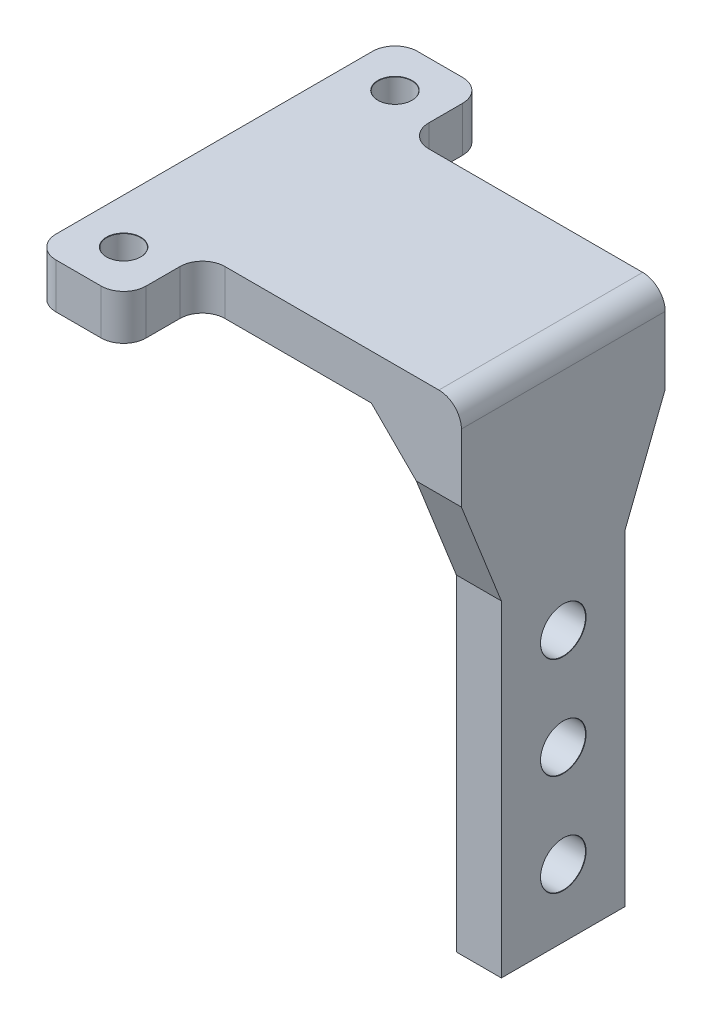
ISO-10303-21;
HEADER;
FILE_DESCRIPTION(('STEP AP214'),'2;1');
FILE_NAME('part.step','',(''),(''),'','','');
FILE_SCHEMA(('AUTOMOTIVE_DESIGN { 1 0 10303 214 1 1 1 1 }'));
ENDSEC;
DATA;
#1=APPLICATION_CONTEXT('core data for automotive mechanical design processes');
#2=APPLICATION_PROTOCOL_DEFINITION('international standard','automotive_design',2000,#1);
#3=PRODUCT_CONTEXT('',#1,'mechanical');
#4=PRODUCT('Part','Part','',(#3));
#5=PRODUCT_RELATED_PRODUCT_CATEGORY('part','',(#4));
#6=PRODUCT_DEFINITION_FORMATION('','',#4);
#7=PRODUCT_DEFINITION_CONTEXT('part definition',#1,'design');
#8=PRODUCT_DEFINITION('design','',#6,#7);
#9=PRODUCT_DEFINITION_SHAPE('','',#8);
#10=(LENGTH_UNIT() NAMED_UNIT(*) SI_UNIT(.MILLI.,.METRE.));
#11=(NAMED_UNIT(*) PLANE_ANGLE_UNIT() SI_UNIT($,.RADIAN.));
#12=(NAMED_UNIT(*) SI_UNIT($,.STERADIAN.) SOLID_ANGLE_UNIT());
#13=UNCERTAINTY_MEASURE_WITH_UNIT(LENGTH_MEASURE(1.E-05),#10,'distance_accuracy_value','');
#14=(GEOMETRIC_REPRESENTATION_CONTEXT(3) GLOBAL_UNCERTAINTY_ASSIGNED_CONTEXT((#13)) GLOBAL_UNIT_ASSIGNED_CONTEXT((#10,
#11,#12)) REPRESENTATION_CONTEXT('',''));
#15=CARTESIAN_POINT('',(0.,0.,0.));
#16=DIRECTION('',(0.,0.,1.));
#17=DIRECTION('',(1.,0.,0.));
#18=AXIS2_PLACEMENT_3D('',#15,#16,#17);
#19=CARTESIAN_POINT('',(0.,0.,0.));
#20=DIRECTION('',(0.,1.,0.));
#21=DIRECTION('',(0.,0.,1.));
#22=AXIS2_PLACEMENT_3D('',#19,#20,#21);
#23=PLANE('',#22);
#24=CARTESIAN_POINT('',(4.,0.,12.05));
#25=DIRECTION('',(0.,1.,0.));
#26=DIRECTION('',(0.,0.,1.));
#27=AXIS2_PLACEMENT_3D('',#24,#25,#26);
#28=CIRCLE('',#27,1.5);
#29=CARTESIAN_POINT('',(4.,0.,13.55));
#30=VERTEX_POINT('',#29);
#31=EDGE_CURVE('E344',#30,#30,#28,.T.);
#32=ORIENTED_EDGE('',*,*,#31,.T.);
#33=EDGE_LOOP('',(#32));
#34=FACE_BOUND('',#33,.T.);
#35=CARTESIAN_POINT('',(4.,0.,-12.05));
#36=DIRECTION('',(0.,1.,0.));
#37=DIRECTION('',(0.,0.,1.));
#38=AXIS2_PLACEMENT_3D('',#35,#36,#37);
#39=CIRCLE('',#38,1.5);
#40=CARTESIAN_POINT('',(4.,0.,-10.55));
#41=VERTEX_POINT('',#40);
#42=EDGE_CURVE('E335',#41,#41,#39,.T.);
#43=ORIENTED_EDGE('',*,*,#42,.T.);
#44=EDGE_LOOP('',(#43));
#45=FACE_BOUND('',#44,.T.);
#46=DIRECTION('',(-1.,0.,0.));
#47=VECTOR('',#46,1.);
#48=CARTESIAN_POINT('',(31.,0.,-9.05));
#49=LINE('',#48,#47);
#50=CARTESIAN_POINT('',(23.,0.,-9.05));
#51=VERTEX_POINT('',#50);
#52=CARTESIAN_POINT('',(10.,0.,-9.05));
#53=VERTEX_POINT('',#52);
#54=EDGE_CURVE('E381',#51,#53,#49,.T.);
#55=ORIENTED_EDGE('',*,*,#54,.F.);
#56=DIRECTION('',(0.,0.,1.));
#57=VECTOR('',#56,1.);
#58=CARTESIAN_POINT('',(23.,0.,9.05));
#59=LINE('',#58,#57);
#60=CARTESIAN_POINT('',(23.,0.,9.05));
#61=VERTEX_POINT('',#60);
#62=EDGE_CURVE('E280',#51,#61,#59,.T.);
#63=ORIENTED_EDGE('',*,*,#62,.T.);
#64=DIRECTION('',(1.,0.,0.));
#65=VECTOR('',#64,1.);
#66=CARTESIAN_POINT('',(8.,0.,9.05));
#67=LINE('',#66,#65);
#68=CARTESIAN_POINT('',(10.,0.,9.05));
#69=VERTEX_POINT('',#68);
#70=EDGE_CURVE('E379',#69,#61,#67,.T.);
#71=ORIENTED_EDGE('',*,*,#70,.F.);
#72=CARTESIAN_POINT('',(10.,0.,11.05));
#73=DIRECTION('',(0.,1.,0.));
#74=DIRECTION('',(0.,0.,1.));
#75=AXIS2_PLACEMENT_3D('',#72,#73,#74);
#76=CIRCLE('',#75,2.);
#77=CARTESIAN_POINT('',(8.,0.,11.05));
#78=VERTEX_POINT('',#77);
#79=EDGE_CURVE('E273',#69,#78,#76,.T.);
#80=ORIENTED_EDGE('',*,*,#79,.T.);
#81=DIRECTION('',(0.,0.,-1.));
#82=VECTOR('',#81,1.);
#83=CARTESIAN_POINT('',(8.,0.,16.05));
#84=LINE('',#83,#82);
#85=CARTESIAN_POINT('',(8.,0.,14.05));
#86=VERTEX_POINT('',#85);
#87=EDGE_CURVE('E376',#86,#78,#84,.T.);
#88=ORIENTED_EDGE('',*,*,#87,.F.);
#89=CARTESIAN_POINT('',(6.,0.,14.05));
#90=DIRECTION('',(0.,1.,0.));
#91=DIRECTION('',(0.,0.,1.));
#92=AXIS2_PLACEMENT_3D('',#89,#90,#91);
#93=CIRCLE('',#92,2.);
#94=CARTESIAN_POINT('',(6.,0.,16.05));
#95=VERTEX_POINT('',#94);
#96=EDGE_CURVE('E226',#86,#95,#93,.F.);
#97=ORIENTED_EDGE('',*,*,#96,.T.);
#98=DIRECTION('',(1.,0.,0.));
#99=VECTOR('',#98,1.);
#100=CARTESIAN_POINT('',(0.,0.,16.05));
#101=LINE('',#100,#99);
#102=CARTESIAN_POINT('',(2.,0.,16.05));
#103=VERTEX_POINT('',#102);
#104=EDGE_CURVE('E373',#103,#95,#101,.T.);
#105=ORIENTED_EDGE('',*,*,#104,.F.);
#106=CARTESIAN_POINT('',(2.,0.,14.05));
#107=DIRECTION('',(0.,1.,0.));
#108=DIRECTION('',(0.,0.,1.));
#109=AXIS2_PLACEMENT_3D('',#106,#107,#108);
#110=CIRCLE('',#109,2.);
#111=CARTESIAN_POINT('',(0.,0.,14.05));
#112=VERTEX_POINT('',#111);
#113=EDGE_CURVE('E228',#103,#112,#110,.F.);
#114=ORIENTED_EDGE('',*,*,#113,.T.);
#115=DIRECTION('',(0.,0.,1.));
#116=VECTOR('',#115,1.);
#117=CARTESIAN_POINT('',(0.,0.,-16.05));
#118=LINE('',#117,#116);
#119=CARTESIAN_POINT('',(0.,0.,-14.05));
#120=VERTEX_POINT('',#119);
#121=EDGE_CURVE('E370',#120,#112,#118,.T.);
#122=ORIENTED_EDGE('',*,*,#121,.F.);
#123=CARTESIAN_POINT('',(2.,0.,-14.05));
#124=DIRECTION('',(0.,1.,0.));
#125=DIRECTION('',(0.,0.,1.));
#126=AXIS2_PLACEMENT_3D('',#123,#124,#125);
#127=CIRCLE('',#126,2.);
#128=CARTESIAN_POINT('',(2.,0.,-16.05));
#129=VERTEX_POINT('',#128);
#130=EDGE_CURVE('E232',#120,#129,#127,.F.);
#131=ORIENTED_EDGE('',*,*,#130,.T.);
#132=DIRECTION('',(-1.,0.,0.));
#133=VECTOR('',#132,1.);
#134=CARTESIAN_POINT('',(8.,0.,-16.05));
#135=LINE('',#134,#133);
#136=CARTESIAN_POINT('',(6.,0.,-16.05));
#137=VERTEX_POINT('',#136);
#138=EDGE_CURVE('E347',#137,#129,#135,.T.);
#139=ORIENTED_EDGE('',*,*,#138,.F.);
#140=CARTESIAN_POINT('',(6.,0.,-14.05));
#141=DIRECTION('',(0.,1.,0.));
#142=DIRECTION('',(0.,0.,1.));
#143=AXIS2_PLACEMENT_3D('',#140,#141,#142);
#144=CIRCLE('',#143,2.);
#145=CARTESIAN_POINT('',(8.,0.,-14.05));
#146=VERTEX_POINT('',#145);
#147=EDGE_CURVE('E230',#137,#146,#144,.F.);
#148=ORIENTED_EDGE('',*,*,#147,.T.);
#149=DIRECTION('',(0.,0.,-1.));
#150=VECTOR('',#149,1.);
#151=CARTESIAN_POINT('',(8.,0.,-9.05));
#152=LINE('',#151,#150);
#153=CARTESIAN_POINT('',(8.,0.,-11.05));
#154=VERTEX_POINT('',#153);
#155=EDGE_CURVE('E352',#154,#146,#152,.T.);
#156=ORIENTED_EDGE('',*,*,#155,.F.);
#157=CARTESIAN_POINT('',(10.,0.,-11.05));
#158=DIRECTION('',(0.,1.,0.));
#159=DIRECTION('',(0.,0.,1.));
#160=AXIS2_PLACEMENT_3D('',#157,#158,#159);
#161=CIRCLE('',#160,2.);
#162=EDGE_CURVE('E268',#154,#53,#161,.T.);
#163=ORIENTED_EDGE('',*,*,#162,.T.);
#164=EDGE_LOOP('',(#55,#63,#71,#80,#88,#97,#105,#114,#122,#131,#139,#148,#156,#163));
#165=FACE_BOUND('',#164,.T.);
#166=ADVANCED_FACE('F43',(#34,#45,#165),#23,.F.);
#167=CARTESIAN_POINT('',(8.,4.,-16.05));
#168=DIRECTION('',(0.,0.,1.));
#169=DIRECTION('',(1.,0.,0.));
#170=AXIS2_PLACEMENT_3D('',#167,#168,#169);
#171=PLANE('',#170);
#172=ORIENTED_EDGE('',*,*,#138,.T.);
#173=DIRECTION('',(0.,-1.,0.));
#174=VECTOR('',#173,1.);
#175=CARTESIAN_POINT('',(2.,4.,-16.05));
#176=LINE('',#175,#174);
#177=CARTESIAN_POINT('',(2.,4.,-16.05));
#178=VERTEX_POINT('',#177);
#179=EDGE_CURVE('E237',#129,#178,#176,.F.);
#180=ORIENTED_EDGE('',*,*,#179,.T.);
#181=DIRECTION('',(-1.,0.,0.));
#182=VECTOR('',#181,1.);
#183=CARTESIAN_POINT('',(8.,4.,-16.05));
#184=LINE('',#183,#182);
#185=CARTESIAN_POINT('',(6.,4.,-16.05));
#186=VERTEX_POINT('',#185);
#187=EDGE_CURVE('E348',#186,#178,#184,.T.);
#188=ORIENTED_EDGE('',*,*,#187,.F.);
#189=DIRECTION('',(0.,-1.,0.));
#190=VECTOR('',#189,1.);
#191=CARTESIAN_POINT('',(6.,4.,-16.05));
#192=LINE('',#191,#190);
#193=EDGE_CURVE('E234',#186,#137,#192,.T.);
#194=ORIENTED_EDGE('',*,*,#193,.T.);
#195=EDGE_LOOP('',(#172,#180,#188,#194));
#196=FACE_BOUND('',#195,.T.);
#197=ADVANCED_FACE('F399',(#196),#171,.F.);
#198=CARTESIAN_POINT('',(0.,4.,-16.05));
#199=DIRECTION('',(1.,0.,0.));
#200=DIRECTION('',(0.,0.,-1.));
#201=AXIS2_PLACEMENT_3D('',#198,#199,#200);
#202=PLANE('',#201);
#203=DIRECTION('',(0.,0.,1.));
#204=VECTOR('',#203,1.);
#205=CARTESIAN_POINT('',(0.,4.,-16.05));
#206=LINE('',#205,#204);
#207=CARTESIAN_POINT('',(0.,4.,-14.05));
#208=VERTEX_POINT('',#207);
#209=CARTESIAN_POINT('',(0.,4.,14.05));
#210=VERTEX_POINT('',#209);
#211=EDGE_CURVE('E351',#208,#210,#206,.T.);
#212=ORIENTED_EDGE('',*,*,#211,.F.);
#213=DIRECTION('',(0.,-1.,0.));
#214=VECTOR('',#213,1.);
#215=CARTESIAN_POINT('',(0.,4.,-14.05));
#216=LINE('',#215,#214);
#217=EDGE_CURVE('E217',#208,#120,#216,.T.);
#218=ORIENTED_EDGE('',*,*,#217,.T.);
#219=ORIENTED_EDGE('',*,*,#121,.T.);
#220=DIRECTION('',(0.,-1.,0.));
#221=VECTOR('',#220,1.);
#222=CARTESIAN_POINT('',(0.,4.,14.05));
#223=LINE('',#222,#221);
#224=EDGE_CURVE('E214',#112,#210,#223,.F.);
#225=ORIENTED_EDGE('',*,*,#224,.T.);
#226=EDGE_LOOP('',(#212,#218,#219,#225));
#227=FACE_BOUND('',#226,.T.);
#228=ADVANCED_FACE('F408',(#227),#202,.F.);
#229=CARTESIAN_POINT('',(0.,4.,16.05));
#230=DIRECTION('',(0.,0.,-1.));
#231=DIRECTION('',(-1.,0.,0.));
#232=AXIS2_PLACEMENT_3D('',#229,#230,#231);
#233=PLANE('',#232);
#234=DIRECTION('',(1.,0.,0.));
#235=VECTOR('',#234,1.);
#236=CARTESIAN_POINT('',(0.,4.,16.05));
#237=LINE('',#236,#235);
#238=CARTESIAN_POINT('',(2.,4.,16.05));
#239=VERTEX_POINT('',#238);
#240=CARTESIAN_POINT('',(6.,4.,16.05));
#241=VERTEX_POINT('',#240);
#242=EDGE_CURVE('E355',#239,#241,#237,.T.);
#243=ORIENTED_EDGE('',*,*,#242,.F.);
#244=DIRECTION('',(0.,-1.,0.));
#245=VECTOR('',#244,1.);
#246=CARTESIAN_POINT('',(2.,4.,16.05));
#247=LINE('',#246,#245);
#248=EDGE_CURVE('E257',#239,#103,#247,.T.);
#249=ORIENTED_EDGE('',*,*,#248,.T.);
#250=ORIENTED_EDGE('',*,*,#104,.T.);
#251=DIRECTION('',(0.,-1.,0.));
#252=VECTOR('',#251,1.);
#253=CARTESIAN_POINT('',(6.,4.,16.05));
#254=LINE('',#253,#252);
#255=EDGE_CURVE('E255',#95,#241,#254,.F.);
#256=ORIENTED_EDGE('',*,*,#255,.T.);
#257=EDGE_LOOP('',(#243,#249,#250,#256));
#258=FACE_BOUND('',#257,.T.);
#259=ADVANCED_FACE('F417',(#258),#233,.F.);
#260=CARTESIAN_POINT('',(8.,4.,16.05));
#261=DIRECTION('',(-1.,0.,0.));
#262=DIRECTION('',(0.,0.,1.));
#263=AXIS2_PLACEMENT_3D('',#260,#261,#262);
#264=PLANE('',#263);
#265=DIRECTION('',(0.,0.,-1.));
#266=VECTOR('',#265,1.);
#267=CARTESIAN_POINT('',(8.,4.,16.05));
#268=LINE('',#267,#266);
#269=CARTESIAN_POINT('',(8.,4.,14.05));
#270=VERTEX_POINT('',#269);
#271=CARTESIAN_POINT('',(8.,4.,11.05));
#272=VERTEX_POINT('',#271);
#273=EDGE_CURVE('E358',#270,#272,#268,.T.);
#274=ORIENTED_EDGE('',*,*,#273,.F.);
#275=DIRECTION('',(0.,-1.,0.));
#276=VECTOR('',#275,1.);
#277=CARTESIAN_POINT('',(8.,4.,14.05));
#278=LINE('',#277,#276);
#279=EDGE_CURVE('E262',#270,#86,#278,.T.);
#280=ORIENTED_EDGE('',*,*,#279,.T.);
#281=ORIENTED_EDGE('',*,*,#87,.T.);
#282=DIRECTION('',(0.,-1.,0.));
#283=VECTOR('',#282,1.);
#284=CARTESIAN_POINT('',(8.,4.,11.05));
#285=LINE('',#284,#283);
#286=EDGE_CURVE('E260',#78,#272,#285,.F.);
#287=ORIENTED_EDGE('',*,*,#286,.T.);
#288=EDGE_LOOP('',(#274,#280,#281,#287));
#289=FACE_BOUND('',#288,.T.);
#290=ADVANCED_FACE('F426',(#289),#264,.F.);
#291=CARTESIAN_POINT('',(8.,4.,9.05));
#292=DIRECTION('',(0.,0.,-1.));
#293=DIRECTION('',(-1.,0.,0.));
#294=AXIS2_PLACEMENT_3D('',#291,#292,#293);
#295=PLANE('',#294);
#296=DIRECTION('',(-0.707106781186544,0.707106781186551,0.));
#297=VECTOR('',#296,1.);
#298=CARTESIAN_POINT('',(13.5000000000001,9.50000000000002,9.05));
#299=LINE('',#298,#297);
#300=CARTESIAN_POINT('',(27.,-4.00000000000005,9.05));
#301=VERTEX_POINT('',#300);
#302=EDGE_CURVE('E207',#61,#301,#299,.F.);
#303=ORIENTED_EDGE('',*,*,#302,.T.);
#304=DIRECTION('',(-1.,0.,0.));
#305=VECTOR('',#304,1.);
#306=CARTESIAN_POINT('',(31.,-4.00000000000005,9.05));
#307=LINE('',#306,#305);
#308=CARTESIAN_POINT('',(31.,-4.00000000000005,9.05));
#309=VERTEX_POINT('',#308);
#310=EDGE_CURVE('E190',#309,#301,#307,.T.);
#311=ORIENTED_EDGE('',*,*,#310,.F.);
#312=DIRECTION('',(0.,-1.,0.));
#313=VECTOR('',#312,1.);
#314=CARTESIAN_POINT('',(31.,4.,9.05));
#315=LINE('',#314,#313);
#316=CARTESIAN_POINT('',(31.,2.,9.05));
#317=VERTEX_POINT('',#316);
#318=EDGE_CURVE('E203',#317,#309,#315,.T.);
#319=ORIENTED_EDGE('',*,*,#318,.F.);
#320=CARTESIAN_POINT('',(29.,2.,9.05));
#321=DIRECTION('',(0.,0.,-1.));
#322=DIRECTION('',(-1.,0.,0.));
#323=AXIS2_PLACEMENT_3D('',#320,#321,#322);
#324=CIRCLE('',#323,2.);
#325=CARTESIAN_POINT('',(29.,4.,9.05));
#326=VERTEX_POINT('',#325);
#327=EDGE_CURVE('E51',#317,#326,#324,.F.);
#328=ORIENTED_EDGE('',*,*,#327,.T.);
#329=DIRECTION('',(1.,0.,0.));
#330=VECTOR('',#329,1.);
#331=CARTESIAN_POINT('',(8.,4.,9.05));
#332=LINE('',#331,#330);
#333=CARTESIAN_POINT('',(10.,4.,9.05));
#334=VERTEX_POINT('',#333);
#335=EDGE_CURVE('E361',#334,#326,#332,.T.);
#336=ORIENTED_EDGE('',*,*,#335,.F.);
#337=DIRECTION('',(0.,-1.,0.));
#338=VECTOR('',#337,1.);
#339=CARTESIAN_POINT('',(10.,0.,9.05));
#340=LINE('',#339,#338);
#341=EDGE_CURVE('E265',#334,#69,#340,.T.);
#342=ORIENTED_EDGE('',*,*,#341,.T.);
#343=ORIENTED_EDGE('',*,*,#70,.T.);
#344=EDGE_LOOP('',(#303,#311,#319,#328,#336,#342,#343));
#345=FACE_BOUND('',#344,.T.);
#346=ADVANCED_FACE('F202',(#345),#295,.F.);
#347=CARTESIAN_POINT('',(31.,4.,9.05));
#348=DIRECTION('',(-1.,0.,0.));
#349=DIRECTION('',(0.,0.,1.));
#350=AXIS2_PLACEMENT_3D('',#347,#348,#349);
#351=PLANE('',#350);
#352=CARTESIAN_POINT('',(31.,-36.,0.));
#353=DIRECTION('',(1.,0.,0.));
#354=DIRECTION('',(0.,0.,-1.));
#355=AXIS2_PLACEMENT_3D('',#352,#353,#354);
#356=CIRCLE('',#355,2.025);
#357=CARTESIAN_POINT('',(31.,-36.,-2.025));
#358=VERTEX_POINT('',#357);
#359=EDGE_CURVE('E310',#358,#358,#356,.T.);
#360=ORIENTED_EDGE('',*,*,#359,.F.);
#361=EDGE_LOOP('',(#360));
#362=FACE_BOUND('',#361,.T.);
#363=CARTESIAN_POINT('',(31.,-27.,0.));
#364=DIRECTION('',(1.,0.,0.));
#365=DIRECTION('',(0.,0.,-1.));
#366=AXIS2_PLACEMENT_3D('',#363,#364,#365);
#367=CIRCLE('',#366,2.025);
#368=CARTESIAN_POINT('',(31.,-27.,-2.025));
#369=VERTEX_POINT('',#368);
#370=EDGE_CURVE('E303',#369,#369,#367,.T.);
#371=ORIENTED_EDGE('',*,*,#370,.F.);
#372=EDGE_LOOP('',(#371));
#373=FACE_BOUND('',#372,.T.);
#374=CARTESIAN_POINT('',(31.,-18.,0.));
#375=DIRECTION('',(1.,0.,0.));
#376=DIRECTION('',(0.,0.,-1.));
#377=AXIS2_PLACEMENT_3D('',#374,#375,#376);
#378=CIRCLE('',#377,2.025);
#379=CARTESIAN_POINT('',(31.,-18.,-2.025));
#380=VERTEX_POINT('',#379);
#381=EDGE_CURVE('E299',#380,#380,#378,.T.);
#382=ORIENTED_EDGE('',*,*,#381,.F.);
#383=EDGE_LOOP('',(#382));
#384=FACE_BOUND('',#383,.T.);
#385=DIRECTION('',(0.,-0.930248086317103,-0.366931189602858));
#386=VECTOR('',#385,1.);
#387=CARTESIAN_POINT('',(31.,-4.00000000000005,9.05));
#388=LINE('',#387,#386);
#389=CARTESIAN_POINT('',(31.,-13.,5.5));
#390=VERTEX_POINT('',#389);
#391=EDGE_CURVE('E186',#309,#390,#388,.T.);
#392=ORIENTED_EDGE('',*,*,#391,.T.);
#393=DIRECTION('',(0.,-1.,0.));
#394=VECTOR('',#393,1.);
#395=CARTESIAN_POINT('',(31.,-13.,5.5));
#396=LINE('',#395,#394);
#397=CARTESIAN_POINT('',(31.,-42.,5.5));
#398=VERTEX_POINT('',#397);
#399=EDGE_CURVE('E197',#390,#398,#396,.T.);
#400=ORIENTED_EDGE('',*,*,#399,.T.);
#401=DIRECTION('',(0.,0.,1.));
#402=VECTOR('',#401,1.);
#403=CARTESIAN_POINT('',(31.,-42.,9.05));
#404=LINE('',#403,#402);
#405=CARTESIAN_POINT('',(31.,-42.,-5.499999999941));
#406=VERTEX_POINT('',#405);
#407=EDGE_CURVE('E295',#406,#398,#404,.T.);
#408=ORIENTED_EDGE('',*,*,#407,.F.);
#409=DIRECTION('',(0.,1.,0.));
#410=VECTOR('',#409,1.);
#411=CARTESIAN_POINT('',(31.,-13.,-5.499999999941));
#412=LINE('',#411,#410);
#413=CARTESIAN_POINT('',(31.,-13.,-5.499999999941));
#414=VERTEX_POINT('',#413);
#415=EDGE_CURVE('E66',#406,#414,#412,.T.);
#416=ORIENTED_EDGE('',*,*,#415,.T.);
#417=DIRECTION('',(0.,0.930248086315021,-0.366931189608135));
#418=VECTOR('',#417,1.);
#419=CARTESIAN_POINT('',(31.,-4.00000000000005,-9.05));
#420=LINE('',#419,#418);
#421=CARTESIAN_POINT('',(31.,-4.00000000000005,-9.05));
#422=VERTEX_POINT('',#421);
#423=EDGE_CURVE('E461',#414,#422,#420,.T.);
#424=ORIENTED_EDGE('',*,*,#423,.T.);
#425=DIRECTION('',(0.,-1.,0.));
#426=VECTOR('',#425,1.);
#427=CARTESIAN_POINT('',(31.,4.,-9.05));
#428=LINE('',#427,#426);
#429=CARTESIAN_POINT('',(31.,2.,-9.05));
#430=VERTEX_POINT('',#429);
#431=EDGE_CURVE('E215',#430,#422,#428,.T.);
#432=ORIENTED_EDGE('',*,*,#431,.F.);
#433=DIRECTION('',(0.,0.,-1.));
#434=VECTOR('',#433,1.);
#435=CARTESIAN_POINT('',(31.,2.,9.05));
#436=LINE('',#435,#434);
#437=EDGE_CURVE('E213',#430,#317,#436,.F.);
#438=ORIENTED_EDGE('',*,*,#437,.T.);
#439=ORIENTED_EDGE('',*,*,#318,.T.);
#440=EDGE_LOOP('',(#392,#400,#408,#416,#424,#432,#438,#439));
#441=FACE_BOUND('',#440,.T.);
#442=ADVANCED_FACE('F210',(#362,#373,#384,#441),#351,.F.);
#443=CARTESIAN_POINT('',(31.,4.,-9.05));
#444=DIRECTION('',(0.,0.,1.));
#445=DIRECTION('',(1.,0.,0.));
#446=AXIS2_PLACEMENT_3D('',#443,#444,#445);
#447=PLANE('',#446);
#448=ORIENTED_EDGE('',*,*,#431,.T.);
#449=DIRECTION('',(-1.,0.,0.));
#450=VECTOR('',#449,1.);
#451=CARTESIAN_POINT('',(31.,-4.00000000000005,-9.05));
#452=LINE('',#451,#450);
#453=CARTESIAN_POINT('',(27.,-4.00000000000005,-9.05));
#454=VERTEX_POINT('',#453);
#455=EDGE_CURVE('E465',#422,#454,#452,.T.);
#456=ORIENTED_EDGE('',*,*,#455,.T.);
#457=DIRECTION('',(0.707106781186544,-0.707106781186551,0.));
#458=VECTOR('',#457,1.);
#459=CARTESIAN_POINT('',(25.,-1.99999999999998,-9.05));
#460=LINE('',#459,#458);
#461=EDGE_CURVE('E282',#454,#51,#460,.F.);
#462=ORIENTED_EDGE('',*,*,#461,.T.);
#463=ORIENTED_EDGE('',*,*,#54,.T.);
#464=DIRECTION('',(0.,-1.,0.));
#465=VECTOR('',#464,1.);
#466=CARTESIAN_POINT('',(10.,4.,-9.05));
#467=LINE('',#466,#465);
#468=CARTESIAN_POINT('',(10.,4.,-9.05));
#469=VERTEX_POINT('',#468);
#470=EDGE_CURVE('E252',#53,#469,#467,.F.);
#471=ORIENTED_EDGE('',*,*,#470,.T.);
#472=DIRECTION('',(-1.,0.,0.));
#473=VECTOR('',#472,1.);
#474=CARTESIAN_POINT('',(31.,4.,-9.05));
#475=LINE('',#474,#473);
#476=CARTESIAN_POINT('',(29.,4.,-9.05));
#477=VERTEX_POINT('',#476);
#478=EDGE_CURVE('E364',#477,#469,#475,.T.);
#479=ORIENTED_EDGE('',*,*,#478,.F.);
#480=CARTESIAN_POINT('',(29.,2.,-9.05));
#481=DIRECTION('',(0.,0.,1.));
#482=DIRECTION('',(1.,0.,0.));
#483=AXIS2_PLACEMENT_3D('',#480,#481,#482);
#484=CIRCLE('',#483,2.);
#485=EDGE_CURVE('E288',#477,#430,#484,.F.);
#486=ORIENTED_EDGE('',*,*,#485,.T.);
#487=EDGE_LOOP('',(#448,#456,#462,#463,#471,#479,#486));
#488=FACE_BOUND('',#487,.T.);
#489=ADVANCED_FACE('F438',(#488),#447,.F.);
#490=CARTESIAN_POINT('',(8.,4.,-9.05));
#491=DIRECTION('',(-1.,0.,0.));
#492=DIRECTION('',(0.,0.,1.));
#493=AXIS2_PLACEMENT_3D('',#490,#491,#492);
#494=PLANE('',#493);
#495=DIRECTION('',(0.,0.,-1.));
#496=VECTOR('',#495,1.);
#497=CARTESIAN_POINT('',(8.,4.,-9.05));
#498=LINE('',#497,#496);
#499=CARTESIAN_POINT('',(8.,4.,-11.05));
#500=VERTEX_POINT('',#499);
#501=CARTESIAN_POINT('',(8.,4.,-14.05));
#502=VERTEX_POINT('',#501);
#503=EDGE_CURVE('E220',#500,#502,#498,.T.);
#504=ORIENTED_EDGE('',*,*,#503,.F.);
#505=DIRECTION('',(0.,-1.,0.));
#506=VECTOR('',#505,1.);
#507=CARTESIAN_POINT('',(8.,0.,-11.05));
#508=LINE('',#507,#506);
#509=EDGE_CURVE('E249',#500,#154,#508,.T.);
#510=ORIENTED_EDGE('',*,*,#509,.T.);
#511=ORIENTED_EDGE('',*,*,#155,.T.);
#512=DIRECTION('',(0.,-1.,0.));
#513=VECTOR('',#512,1.);
#514=CARTESIAN_POINT('',(8.,4.,-14.05));
#515=LINE('',#514,#513);
#516=EDGE_CURVE('E247',#146,#502,#515,.F.);
#517=ORIENTED_EDGE('',*,*,#516,.T.);
#518=EDGE_LOOP('',(#504,#510,#511,#517));
#519=FACE_BOUND('',#518,.T.);
#520=ADVANCED_FACE('F387',(#519),#494,.F.);
#521=CARTESIAN_POINT('',(0.,4.,0.));
#522=DIRECTION('',(0.,1.,0.));
#523=DIRECTION('',(0.,0.,1.));
#524=AXIS2_PLACEMENT_3D('',#521,#522,#523);
#525=PLANE('',#524);
#526=CARTESIAN_POINT('',(4.,4.,-12.05));
#527=DIRECTION('',(0.,1.,0.));
#528=DIRECTION('',(0.,0.,1.));
#529=AXIS2_PLACEMENT_3D('',#526,#527,#528);
#530=CIRCLE('',#529,1.525);
#531=CARTESIAN_POINT('',(4.,4.,-10.525));
#532=VERTEX_POINT('',#531);
#533=EDGE_CURVE('E329',#532,#532,#530,.T.);
#534=ORIENTED_EDGE('',*,*,#533,.F.);
#535=EDGE_LOOP('',(#534));
#536=FACE_BOUND('',#535,.T.);
#537=CARTESIAN_POINT('',(4.,4.,12.05));
#538=DIRECTION('',(0.,1.,0.));
#539=DIRECTION('',(0.,0.,1.));
#540=AXIS2_PLACEMENT_3D('',#537,#538,#539);
#541=CIRCLE('',#540,1.525);
#542=CARTESIAN_POINT('',(4.,4.,13.575));
#543=VERTEX_POINT('',#542);
#544=EDGE_CURVE('E338',#543,#543,#541,.T.);
#545=ORIENTED_EDGE('',*,*,#544,.F.);
#546=EDGE_LOOP('',(#545));
#547=FACE_BOUND('',#546,.T.);
#548=ORIENTED_EDGE('',*,*,#335,.T.);
#549=DIRECTION('',(0.,0.,-1.));
#550=VECTOR('',#549,1.);
#551=CARTESIAN_POINT('',(29.,4.,-9.05));
#552=LINE('',#551,#550);
#553=EDGE_CURVE('E285',#326,#477,#552,.T.);
#554=ORIENTED_EDGE('',*,*,#553,.T.);
#555=ORIENTED_EDGE('',*,*,#478,.T.);
#556=CARTESIAN_POINT('',(10.,4.,-11.05));
#557=DIRECTION('',(0.,1.,0.));
#558=DIRECTION('',(0.,0.,1.));
#559=AXIS2_PLACEMENT_3D('',#556,#557,#558);
#560=CIRCLE('',#559,2.);
#561=EDGE_CURVE('E271',#469,#500,#560,.F.);
#562=ORIENTED_EDGE('',*,*,#561,.T.);
#563=ORIENTED_EDGE('',*,*,#503,.T.);
#564=CARTESIAN_POINT('',(6.,4.,-14.05));
#565=DIRECTION('',(0.,1.,0.));
#566=DIRECTION('',(0.,0.,1.));
#567=AXIS2_PLACEMENT_3D('',#564,#565,#566);
#568=CIRCLE('',#567,2.);
#569=EDGE_CURVE('E243',#502,#186,#568,.T.);
#570=ORIENTED_EDGE('',*,*,#569,.T.);
#571=ORIENTED_EDGE('',*,*,#187,.T.);
#572=CARTESIAN_POINT('',(2.,4.,-14.05));
#573=DIRECTION('',(0.,1.,0.));
#574=DIRECTION('',(0.,0.,1.));
#575=AXIS2_PLACEMENT_3D('',#572,#573,#574);
#576=CIRCLE('',#575,2.);
#577=EDGE_CURVE('E245',#178,#208,#576,.T.);
#578=ORIENTED_EDGE('',*,*,#577,.T.);
#579=ORIENTED_EDGE('',*,*,#211,.T.);
#580=CARTESIAN_POINT('',(2.,4.,14.05));
#581=DIRECTION('',(0.,1.,0.));
#582=DIRECTION('',(0.,0.,1.));
#583=AXIS2_PLACEMENT_3D('',#580,#581,#582);
#584=CIRCLE('',#583,2.);
#585=EDGE_CURVE('E241',#210,#239,#584,.T.);
#586=ORIENTED_EDGE('',*,*,#585,.T.);
#587=ORIENTED_EDGE('',*,*,#242,.T.);
#588=CARTESIAN_POINT('',(6.,4.,14.05));
#589=DIRECTION('',(0.,1.,0.));
#590=DIRECTION('',(0.,0.,1.));
#591=AXIS2_PLACEMENT_3D('',#588,#589,#590);
#592=CIRCLE('',#591,2.);
#593=EDGE_CURVE('E239',#241,#270,#592,.T.);
#594=ORIENTED_EDGE('',*,*,#593,.T.);
#595=ORIENTED_EDGE('',*,*,#273,.T.);
#596=CARTESIAN_POINT('',(10.,4.,11.05));
#597=DIRECTION('',(0.,1.,0.));
#598=DIRECTION('',(0.,0.,1.));
#599=AXIS2_PLACEMENT_3D('',#596,#597,#598);
#600=CIRCLE('',#599,2.);
#601=EDGE_CURVE('E275',#272,#334,#600,.F.);
#602=ORIENTED_EDGE('',*,*,#601,.T.);
#603=EDGE_LOOP('',(#548,#554,#555,#562,#563,#570,#571,#578,#579,#586,#587,#594,#595,#602));
#604=FACE_BOUND('',#603,.T.);
#605=ADVANCED_FACE('F396',(#536,#547,#604),#525,.T.);
#606=CARTESIAN_POINT('',(2.,4.,-14.05));
#607=DIRECTION('',(0.,-1.,0.));
#608=DIRECTION('',(0.,0.,-1.));
#609=AXIS2_PLACEMENT_3D('',#606,#607,#608);
#610=CYLINDRICAL_SURFACE('',#609,2.);
#611=ORIENTED_EDGE('',*,*,#577,.F.);
#612=ORIENTED_EDGE('',*,*,#179,.F.);
#613=ORIENTED_EDGE('',*,*,#130,.F.);
#614=ORIENTED_EDGE('',*,*,#217,.F.);
#615=EDGE_LOOP('',(#611,#612,#613,#614));
#616=FACE_BOUND('',#615,.T.);
#617=ADVANCED_FACE('F403',(#616),#610,.T.);
#618=CARTESIAN_POINT('',(10.,4.,-11.05));
#619=DIRECTION('',(0.,1.,0.));
#620=DIRECTION('',(0.,0.,1.));
#621=AXIS2_PLACEMENT_3D('',#618,#619,#620);
#622=CYLINDRICAL_SURFACE('',#621,2.);
#623=ORIENTED_EDGE('',*,*,#561,.F.);
#624=ORIENTED_EDGE('',*,*,#470,.F.);
#625=ORIENTED_EDGE('',*,*,#162,.F.);
#626=ORIENTED_EDGE('',*,*,#509,.F.);
#627=EDGE_LOOP('',(#623,#624,#625,#626));
#628=FACE_BOUND('',#627,.T.);
#629=ADVANCED_FACE('F443',(#628),#622,.F.);
#630=CARTESIAN_POINT('',(6.,4.,-14.05));
#631=DIRECTION('',(0.,-1.,0.));
#632=DIRECTION('',(0.,0.,-1.));
#633=AXIS2_PLACEMENT_3D('',#630,#631,#632);
#634=CYLINDRICAL_SURFACE('',#633,2.);
#635=ORIENTED_EDGE('',*,*,#569,.F.);
#636=ORIENTED_EDGE('',*,*,#516,.F.);
#637=ORIENTED_EDGE('',*,*,#147,.F.);
#638=ORIENTED_EDGE('',*,*,#193,.F.);
#639=EDGE_LOOP('',(#635,#636,#637,#638));
#640=FACE_BOUND('',#639,.T.);
#641=ADVANCED_FACE('F392',(#640),#634,.T.);
#642=CARTESIAN_POINT('',(2.,4.,14.05));
#643=DIRECTION('',(0.,-1.,0.));
#644=DIRECTION('',(0.,0.,-1.));
#645=AXIS2_PLACEMENT_3D('',#642,#643,#644);
#646=CYLINDRICAL_SURFACE('',#645,2.);
#647=ORIENTED_EDGE('',*,*,#585,.F.);
#648=ORIENTED_EDGE('',*,*,#224,.F.);
#649=ORIENTED_EDGE('',*,*,#113,.F.);
#650=ORIENTED_EDGE('',*,*,#248,.F.);
#651=EDGE_LOOP('',(#647,#648,#649,#650));
#652=FACE_BOUND('',#651,.T.);
#653=ADVANCED_FACE('F412',(#652),#646,.T.);
#654=CARTESIAN_POINT('',(6.,4.,14.05));
#655=DIRECTION('',(0.,-1.,0.));
#656=DIRECTION('',(0.,0.,-1.));
#657=AXIS2_PLACEMENT_3D('',#654,#655,#656);
#658=CYLINDRICAL_SURFACE('',#657,2.);
#659=ORIENTED_EDGE('',*,*,#593,.F.);
#660=ORIENTED_EDGE('',*,*,#255,.F.);
#661=ORIENTED_EDGE('',*,*,#96,.F.);
#662=ORIENTED_EDGE('',*,*,#279,.F.);
#663=EDGE_LOOP('',(#659,#660,#661,#662));
#664=FACE_BOUND('',#663,.T.);
#665=ADVANCED_FACE('F421',(#664),#658,.T.);
#666=CARTESIAN_POINT('',(10.,4.,11.05));
#667=DIRECTION('',(0.,1.,0.));
#668=DIRECTION('',(0.,0.,1.));
#669=AXIS2_PLACEMENT_3D('',#666,#667,#668);
#670=CYLINDRICAL_SURFACE('',#669,2.);
#671=ORIENTED_EDGE('',*,*,#601,.F.);
#672=ORIENTED_EDGE('',*,*,#286,.F.);
#673=ORIENTED_EDGE('',*,*,#79,.F.);
#674=ORIENTED_EDGE('',*,*,#341,.F.);
#675=EDGE_LOOP('',(#671,#672,#673,#674));
#676=FACE_BOUND('',#675,.T.);
#677=ADVANCED_FACE('F430',(#676),#670,.F.);
#678=CARTESIAN_POINT('',(4.,4.,12.05));
#679=DIRECTION('',(0.,1.,0.));
#680=DIRECTION('',(0.,0.,1.));
#681=AXIS2_PLACEMENT_3D('',#678,#679,#680);
#682=CYLINDRICAL_SURFACE('',#681,1.5);
#683=ORIENTED_EDGE('',*,*,#31,.F.);
#684=EDGE_LOOP('',(#683));
#685=FACE_BOUND('',#684,.T.);
#686=CARTESIAN_POINT('',(4.,3.975,12.05));
#687=DIRECTION('',(0.,1.,0.));
#688=DIRECTION('',(0.,0.,1.));
#689=AXIS2_PLACEMENT_3D('',#686,#687,#688);
#690=CIRCLE('',#689,1.5);
#691=CARTESIAN_POINT('',(4.,3.975,13.55));
#692=VERTEX_POINT('',#691);
#693=EDGE_CURVE('E341',#692,#692,#690,.T.);
#694=ORIENTED_EDGE('',*,*,#693,.T.);
#695=EDGE_LOOP('',(#694));
#696=FACE_BOUND('',#695,.T.);
#697=ADVANCED_FACE('F524',(#685,#696),#682,.F.);
#698=CARTESIAN_POINT('',(4.,4.,12.05));
#699=DIRECTION('',(0.,1.,0.));
#700=DIRECTION('',(0.,0.,1.));
#701=AXIS2_PLACEMENT_3D('',#698,#699,#700);
#702=CONICAL_SURFACE('',#701,1.525,0.785398163397466);
#703=ORIENTED_EDGE('',*,*,#693,.F.);
#704=EDGE_LOOP('',(#703));
#705=FACE_BOUND('',#704,.T.);
#706=ORIENTED_EDGE('',*,*,#544,.T.);
#707=EDGE_LOOP('',(#706));
#708=FACE_BOUND('',#707,.T.);
#709=ADVANCED_FACE('F549',(#705,#708),#702,.F.);
#710=CARTESIAN_POINT('',(4.,4.,-12.05));
#711=DIRECTION('',(0.,1.,0.));
#712=DIRECTION('',(0.,0.,1.));
#713=AXIS2_PLACEMENT_3D('',#710,#711,#712);
#714=CYLINDRICAL_SURFACE('',#713,1.5);
#715=ORIENTED_EDGE('',*,*,#42,.F.);
#716=EDGE_LOOP('',(#715));
#717=FACE_BOUND('',#716,.T.);
#718=CARTESIAN_POINT('',(4.,3.975,-12.05));
#719=DIRECTION('',(0.,1.,0.));
#720=DIRECTION('',(0.,0.,1.));
#721=AXIS2_PLACEMENT_3D('',#718,#719,#720);
#722=CIRCLE('',#721,1.5);
#723=CARTESIAN_POINT('',(4.,3.975,-10.55));
#724=VERTEX_POINT('',#723);
#725=EDGE_CURVE('E332',#724,#724,#722,.T.);
#726=ORIENTED_EDGE('',*,*,#725,.T.);
#727=EDGE_LOOP('',(#726));
#728=FACE_BOUND('',#727,.T.);
#729=ADVANCED_FACE('F545',(#717,#728),#714,.F.);
#730=CARTESIAN_POINT('',(4.,4.,-12.05));
#731=DIRECTION('',(0.,1.,0.));
#732=DIRECTION('',(0.,0.,1.));
#733=AXIS2_PLACEMENT_3D('',#730,#731,#732);
#734=CONICAL_SURFACE('',#733,1.525,0.785398163397466);
#735=ORIENTED_EDGE('',*,*,#725,.F.);
#736=EDGE_LOOP('',(#735));
#737=FACE_BOUND('',#736,.T.);
#738=ORIENTED_EDGE('',*,*,#533,.T.);
#739=EDGE_LOOP('',(#738));
#740=FACE_BOUND('',#739,.T.);
#741=ADVANCED_FACE('F538',(#737,#740),#734,.F.);
#742=CARTESIAN_POINT('',(27.,-42.,9.05));
#743=DIRECTION('',(1.,0.,0.));
#744=DIRECTION('',(0.,0.,-1.));
#745=AXIS2_PLACEMENT_3D('',#742,#743,#744);
#746=PLANE('',#745);
#747=CARTESIAN_POINT('',(27.,-36.,0.));
#748=DIRECTION('',(1.,0.,0.));
#749=DIRECTION('',(0.,0.,-1.));
#750=AXIS2_PLACEMENT_3D('',#747,#748,#749);
#751=CIRCLE('',#750,1.99999999999999);
#752=CARTESIAN_POINT('',(27.,-36.,-2.));
#753=VERTEX_POINT('',#752);
#754=EDGE_CURVE('E301',#753,#753,#751,.T.);
#755=ORIENTED_EDGE('',*,*,#754,.T.);
#756=EDGE_LOOP('',(#755));
#757=FACE_BOUND('',#756,.T.);
#758=CARTESIAN_POINT('',(27.,-27.,0.));
#759=DIRECTION('',(1.,0.,0.));
#760=DIRECTION('',(0.,0.,-1.));
#761=AXIS2_PLACEMENT_3D('',#758,#759,#760);
#762=CIRCLE('',#761,1.99999999999999);
#763=CARTESIAN_POINT('',(27.,-27.,-2.));
#764=VERTEX_POINT('',#763);
#765=EDGE_CURVE('E297',#764,#764,#762,.T.);
#766=ORIENTED_EDGE('',*,*,#765,.T.);
#767=EDGE_LOOP('',(#766));
#768=FACE_BOUND('',#767,.T.);
#769=CARTESIAN_POINT('',(27.,-18.,0.));
#770=DIRECTION('',(1.,0.,0.));
#771=DIRECTION('',(0.,0.,-1.));
#772=AXIS2_PLACEMENT_3D('',#769,#770,#771);
#773=CIRCLE('',#772,1.99999999999999);
#774=CARTESIAN_POINT('',(27.,-18.,-2.));
#775=VERTEX_POINT('',#774);
#776=EDGE_CURVE('E292',#775,#775,#773,.T.);
#777=ORIENTED_EDGE('',*,*,#776,.T.);
#778=EDGE_LOOP('',(#777));
#779=FACE_BOUND('',#778,.T.);
#780=DIRECTION('',(0.,0.,-1.));
#781=VECTOR('',#780,1.);
#782=CARTESIAN_POINT('',(27.,-42.,9.05));
#783=LINE('',#782,#781);
#784=CARTESIAN_POINT('',(27.,-42.,5.5));
#785=VERTEX_POINT('',#784);
#786=CARTESIAN_POINT('',(27.,-42.,-5.499999999941));
#787=VERTEX_POINT('',#786);
#788=EDGE_CURVE('E327',#785,#787,#783,.T.);
#789=ORIENTED_EDGE('',*,*,#788,.F.);
#790=DIRECTION('',(0.,-1.,0.));
#791=VECTOR('',#790,1.);
#792=CARTESIAN_POINT('',(27.,-13.,5.5));
#793=LINE('',#792,#791);
#794=CARTESIAN_POINT('',(27.,-13.,5.5));
#795=VERTEX_POINT('',#794);
#796=EDGE_CURVE('E58',#795,#785,#793,.T.);
#797=ORIENTED_EDGE('',*,*,#796,.F.);
#798=DIRECTION('',(0.,-0.930248086317103,-0.366931189602858));
#799=VECTOR('',#798,1.);
#800=CARTESIAN_POINT('',(27.,-4.00000000000005,9.05));
#801=LINE('',#800,#799);
#802=EDGE_CURVE('E452',#301,#795,#801,.T.);
#803=ORIENTED_EDGE('',*,*,#802,.F.);
#804=DIRECTION('',(0.,0.,-1.));
#805=VECTOR('',#804,1.);
#806=CARTESIAN_POINT('',(27.,-4.00000000000003,-9.05));
#807=LINE('',#806,#805);
#808=EDGE_CURVE('E277',#301,#454,#807,.T.);
#809=ORIENTED_EDGE('',*,*,#808,.T.);
#810=DIRECTION('',(0.,-0.930248086315021,0.366931189608135));
#811=VECTOR('',#810,1.);
#812=CARTESIAN_POINT('',(27.,-43.0619374481798,6.35776421592699));
#813=LINE('',#812,#811);
#814=CARTESIAN_POINT('',(27.,-13.,-5.499999999941));
#815=VERTEX_POINT('',#814);
#816=EDGE_CURVE('E11',#454,#815,#813,.T.);
#817=ORIENTED_EDGE('',*,*,#816,.T.);
#818=DIRECTION('',(0.,-1.,0.));
#819=VECTOR('',#818,1.);
#820=CARTESIAN_POINT('',(27.,-42.,-5.499999999941));
#821=LINE('',#820,#819);
#822=EDGE_CURVE('E315',#815,#787,#821,.T.);
#823=ORIENTED_EDGE('',*,*,#822,.T.);
#824=EDGE_LOOP('',(#789,#797,#803,#809,#817,#823));
#825=FACE_BOUND('',#824,.T.);
#826=ADVANCED_FACE('F450',(#757,#768,#779,#825),#746,.F.);
#827=CARTESIAN_POINT('',(0.,-42.,0.));
#828=DIRECTION('',(0.,1.,0.));
#829=DIRECTION('',(0.,0.,1.));
#830=AXIS2_PLACEMENT_3D('',#827,#828,#829);
#831=PLANE('',#830);
#832=ORIENTED_EDGE('',*,*,#407,.T.);
#833=DIRECTION('',(-1.,0.,0.));
#834=VECTOR('',#833,1.);
#835=CARTESIAN_POINT('',(31.,-42.,5.5));
#836=LINE('',#835,#834);
#837=EDGE_CURVE('E457',#398,#785,#836,.T.);
#838=ORIENTED_EDGE('',*,*,#837,.T.);
#839=ORIENTED_EDGE('',*,*,#788,.T.);
#840=DIRECTION('',(-1.,0.,0.));
#841=VECTOR('',#840,1.);
#842=CARTESIAN_POINT('',(31.,-42.,-5.499999999941));
#843=LINE('',#842,#841);
#844=EDGE_CURVE('E464',#406,#787,#843,.T.);
#845=ORIENTED_EDGE('',*,*,#844,.F.);
#846=EDGE_LOOP('',(#832,#838,#839,#845));
#847=FACE_BOUND('',#846,.T.);
#848=ADVANCED_FACE('F477',(#847),#831,.F.);
#849=CARTESIAN_POINT('',(27.,-4.00000000000003,9.05));
#850=DIRECTION('',(-0.707106781186551,-0.707106781186544,0.));
#851=DIRECTION('',(0.,0.,1.));
#852=AXIS2_PLACEMENT_3D('',#849,#850,#851);
#853=PLANE('',#852);
#854=ORIENTED_EDGE('',*,*,#302,.F.);
#855=ORIENTED_EDGE('',*,*,#62,.F.);
#856=ORIENTED_EDGE('',*,*,#461,.F.);
#857=ORIENTED_EDGE('',*,*,#808,.F.);
#858=EDGE_LOOP('',(#854,#855,#856,#857));
#859=FACE_BOUND('',#858,.T.);
#860=ADVANCED_FACE('F447',(#859),#853,.T.);
#861=CARTESIAN_POINT('',(29.,2.,0.));
#862=DIRECTION('',(0.,0.,1.));
#863=DIRECTION('',(1.,0.,0.));
#864=AXIS2_PLACEMENT_3D('',#861,#862,#863);
#865=CYLINDRICAL_SURFACE('',#864,2.);
#866=ORIENTED_EDGE('',*,*,#327,.F.);
#867=ORIENTED_EDGE('',*,*,#437,.F.);
#868=ORIENTED_EDGE('',*,*,#485,.F.);
#869=ORIENTED_EDGE('',*,*,#553,.F.);
#870=EDGE_LOOP('',(#866,#867,#868,#869));
#871=FACE_BOUND('',#870,.T.);
#872=ADVANCED_FACE('F45',(#871),#865,.T.);
#873=CARTESIAN_POINT('',(31.,-18.,0.));
#874=DIRECTION('',(1.,0.,0.));
#875=DIRECTION('',(0.,0.,-1.));
#876=AXIS2_PLACEMENT_3D('',#873,#874,#875);
#877=CYLINDRICAL_SURFACE('',#876,1.99999999999999);
#878=CARTESIAN_POINT('',(30.975,-18.,0.));
#879=DIRECTION('',(1.,0.,0.));
#880=DIRECTION('',(0.,0.,-1.));
#881=AXIS2_PLACEMENT_3D('',#878,#879,#880);
#882=CIRCLE('',#881,1.99999999999999);
#883=CARTESIAN_POINT('',(30.975,-18.,-2.));
#884=VERTEX_POINT('',#883);
#885=EDGE_CURVE('E296',#884,#884,#882,.T.);
#886=ORIENTED_EDGE('',*,*,#885,.T.);
#887=EDGE_LOOP('',(#886));
#888=FACE_BOUND('',#887,.T.);
#889=ORIENTED_EDGE('',*,*,#776,.F.);
#890=EDGE_LOOP('',(#889));
#891=FACE_BOUND('',#890,.T.);
#892=ADVANCED_FACE('F533',(#888,#891),#877,.F.);
#893=CARTESIAN_POINT('',(31.,-18.,0.));
#894=DIRECTION('',(1.,0.,0.));
#895=DIRECTION('',(0.,0.,-1.));
#896=AXIS2_PLACEMENT_3D('',#893,#894,#895);
#897=CONICAL_SURFACE('',#896,2.025,0.785398163397518);
#898=ORIENTED_EDGE('',*,*,#885,.F.);
#899=EDGE_LOOP('',(#898));
#900=FACE_BOUND('',#899,.T.);
#901=ORIENTED_EDGE('',*,*,#381,.T.);
#902=EDGE_LOOP('',(#901));
#903=FACE_BOUND('',#902,.T.);
#904=ADVANCED_FACE('F662',(#900,#903),#897,.F.);
#905=CARTESIAN_POINT('',(31.,-27.,0.));
#906=DIRECTION('',(1.,0.,0.));
#907=DIRECTION('',(0.,0.,-1.));
#908=AXIS2_PLACEMENT_3D('',#905,#906,#907);
#909=CYLINDRICAL_SURFACE('',#908,1.99999999999999);
#910=CARTESIAN_POINT('',(30.975,-27.,0.));
#911=DIRECTION('',(1.,0.,0.));
#912=DIRECTION('',(0.,0.,-1.));
#913=AXIS2_PLACEMENT_3D('',#910,#911,#912);
#914=CIRCLE('',#913,1.99999999999999);
#915=CARTESIAN_POINT('',(30.975,-27.,-2.));
#916=VERTEX_POINT('',#915);
#917=EDGE_CURVE('E300',#916,#916,#914,.T.);
#918=ORIENTED_EDGE('',*,*,#917,.T.);
#919=EDGE_LOOP('',(#918));
#920=FACE_BOUND('',#919,.T.);
#921=ORIENTED_EDGE('',*,*,#765,.F.);
#922=EDGE_LOOP('',(#921));
#923=FACE_BOUND('',#922,.T.);
#924=ADVANCED_FACE('F671',(#920,#923),#909,.F.);
#925=CARTESIAN_POINT('',(31.,-27.,0.));
#926=DIRECTION('',(1.,0.,0.));
#927=DIRECTION('',(0.,0.,-1.));
#928=AXIS2_PLACEMENT_3D('',#925,#926,#927);
#929=CONICAL_SURFACE('',#928,2.025,0.785398163397518);
#930=ORIENTED_EDGE('',*,*,#917,.F.);
#931=EDGE_LOOP('',(#930));
#932=FACE_BOUND('',#931,.T.);
#933=ORIENTED_EDGE('',*,*,#370,.T.);
#934=EDGE_LOOP('',(#933));
#935=FACE_BOUND('',#934,.T.);
#936=ADVANCED_FACE('F680',(#932,#935),#929,.F.);
#937=CARTESIAN_POINT('',(31.,-36.,0.));
#938=DIRECTION('',(1.,0.,0.));
#939=DIRECTION('',(0.,0.,-1.));
#940=AXIS2_PLACEMENT_3D('',#937,#938,#939);
#941=CYLINDRICAL_SURFACE('',#940,1.99999999999999);
#942=CARTESIAN_POINT('',(30.975,-36.,0.));
#943=DIRECTION('',(1.,0.,0.));
#944=DIRECTION('',(0.,0.,-1.));
#945=AXIS2_PLACEMENT_3D('',#942,#943,#944);
#946=CIRCLE('',#945,1.99999999999999);
#947=CARTESIAN_POINT('',(30.975,-36.,-2.));
#948=VERTEX_POINT('',#947);
#949=EDGE_CURVE('E304',#948,#948,#946,.T.);
#950=ORIENTED_EDGE('',*,*,#949,.T.);
#951=EDGE_LOOP('',(#950));
#952=FACE_BOUND('',#951,.T.);
#953=ORIENTED_EDGE('',*,*,#754,.F.);
#954=EDGE_LOOP('',(#953));
#955=FACE_BOUND('',#954,.T.);
#956=ADVANCED_FACE('F690',(#952,#955),#941,.F.);
#957=CARTESIAN_POINT('',(31.,-36.,0.));
#958=DIRECTION('',(1.,0.,0.));
#959=DIRECTION('',(0.,0.,-1.));
#960=AXIS2_PLACEMENT_3D('',#957,#958,#959);
#961=CONICAL_SURFACE('',#960,2.025,0.785398163397518);
#962=ORIENTED_EDGE('',*,*,#949,.F.);
#963=EDGE_LOOP('',(#962));
#964=FACE_BOUND('',#963,.T.);
#965=ORIENTED_EDGE('',*,*,#359,.T.);
#966=EDGE_LOOP('',(#965));
#967=FACE_BOUND('',#966,.T.);
#968=ADVANCED_FACE('F700',(#964,#967),#961,.F.);
#969=CARTESIAN_POINT('',(31.,-4.00000000000005,-9.05));
#970=DIRECTION('',(0.,0.366931189608135,0.930248086315021));
#971=DIRECTION('',(0.,-0.930248086315021,0.366931189608135));
#972=AXIS2_PLACEMENT_3D('',#969,#970,#971);
#973=PLANE('',#972);
#974=ORIENTED_EDGE('',*,*,#455,.F.);
#975=ORIENTED_EDGE('',*,*,#423,.F.);
#976=DIRECTION('',(-1.,0.,0.));
#977=VECTOR('',#976,1.);
#978=CARTESIAN_POINT('',(31.,-13.,-5.499999999941));
#979=LINE('',#978,#977);
#980=EDGE_CURVE('E468',#414,#815,#979,.T.);
#981=ORIENTED_EDGE('',*,*,#980,.T.);
#982=ORIENTED_EDGE('',*,*,#816,.F.);
#983=EDGE_LOOP('',(#974,#975,#981,#982));
#984=FACE_BOUND('',#983,.T.);
#985=ADVANCED_FACE('F474',(#984),#973,.F.);
#986=CARTESIAN_POINT('',(31.,-13.,-5.499999999941));
#987=DIRECTION('',(0.,0.,1.));
#988=DIRECTION('',(1.,0.,0.));
#989=AXIS2_PLACEMENT_3D('',#986,#987,#988);
#990=PLANE('',#989);
#991=ORIENTED_EDGE('',*,*,#980,.F.);
#992=ORIENTED_EDGE('',*,*,#415,.F.);
#993=ORIENTED_EDGE('',*,*,#844,.T.);
#994=ORIENTED_EDGE('',*,*,#822,.F.);
#995=EDGE_LOOP('',(#991,#992,#993,#994));
#996=FACE_BOUND('',#995,.T.);
#997=ADVANCED_FACE('F471',(#996),#990,.F.);
#998=CARTESIAN_POINT('',(31.,-13.,5.5));
#999=DIRECTION('',(0.,0.,-1.));
#1000=DIRECTION('',(0.,1.,0.));
#1001=AXIS2_PLACEMENT_3D('',#998,#999,#1000);
#1002=PLANE('',#1001);
#1003=ORIENTED_EDGE('',*,*,#796,.T.);
#1004=ORIENTED_EDGE('',*,*,#837,.F.);
#1005=ORIENTED_EDGE('',*,*,#399,.F.);
#1006=DIRECTION('',(-1.,0.,0.));
#1007=VECTOR('',#1006,1.);
#1008=CARTESIAN_POINT('',(31.,-13.,5.5));
#1009=LINE('',#1008,#1007);
#1010=EDGE_CURVE('E192',#390,#795,#1009,.T.);
#1011=ORIENTED_EDGE('',*,*,#1010,.T.);
#1012=EDGE_LOOP('',(#1003,#1004,#1005,#1011));
#1013=FACE_BOUND('',#1012,.T.);
#1014=ADVANCED_FACE('F478',(#1013),#1002,.F.);
#1015=CARTESIAN_POINT('',(31.,-4.00000000000005,9.05));
#1016=DIRECTION('',(0.,0.366931189602857,-0.930248086317103));
#1017=DIRECTION('',(0.,0.930248086317103,0.366931189602857));
#1018=AXIS2_PLACEMENT_3D('',#1015,#1016,#1017);
#1019=PLANE('',#1018);
#1020=ORIENTED_EDGE('',*,*,#802,.T.);
#1021=ORIENTED_EDGE('',*,*,#1010,.F.);
#1022=ORIENTED_EDGE('',*,*,#391,.F.);
#1023=ORIENTED_EDGE('',*,*,#310,.T.);
#1024=EDGE_LOOP('',(#1020,#1021,#1022,#1023));
#1025=FACE_BOUND('',#1024,.T.);
#1026=ADVANCED_FACE('F189',(#1025),#1019,.F.);
#1027=CLOSED_SHELL('',(#166,#197,#228,#259,#290,#346,#442,#489,#520,#605,#617,#629,#641,#653,
#665,#677,#697,#709,#729,#741,#826,#848,#860,#872,#892,#904,#924,#936,#956,#968,#985,#997,#1014,#1026));
#1028=MANIFOLD_SOLID_BREP('B2',#1027);
#1029=ADVANCED_BREP_SHAPE_REPRESENTATION('',(#18,#1028),#14);
#1030=SHAPE_DEFINITION_REPRESENTATION(#9,#1029);
ENDSEC;
END-ISO-10303-21;
